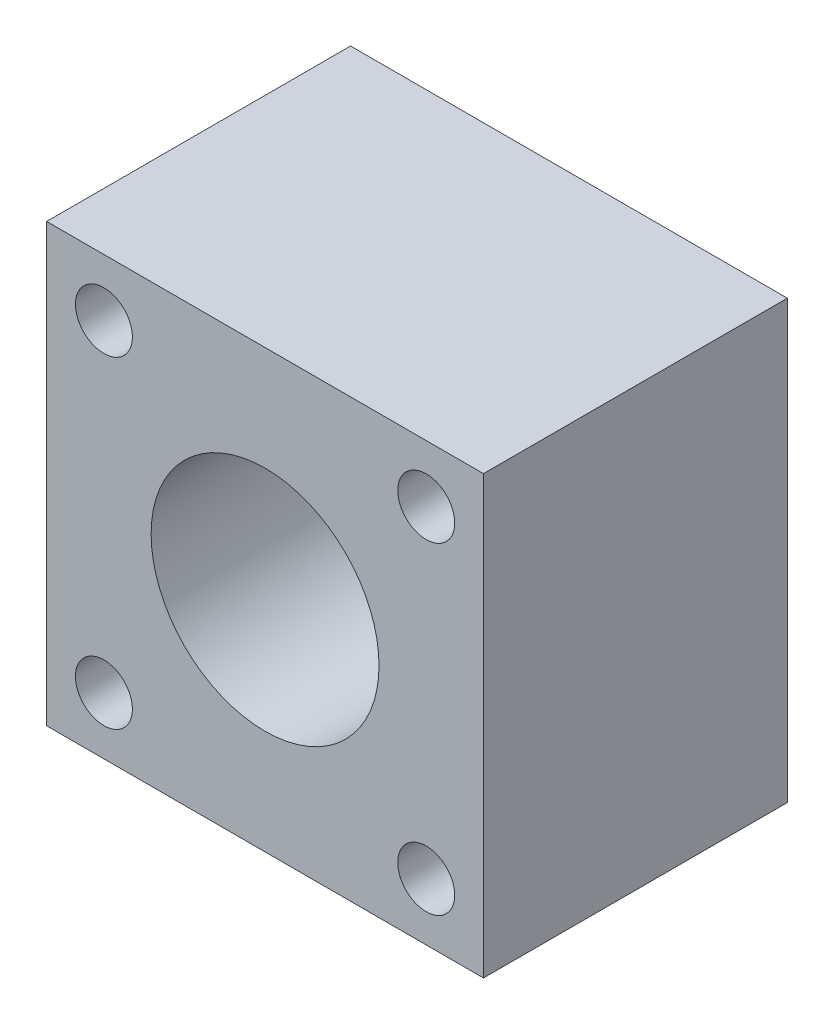
ISO-10303-21;
HEADER;
FILE_DESCRIPTION(('STEP AP214'),'2;1');
FILE_NAME('part.step','',(''),(''),'','','');
FILE_SCHEMA(('AUTOMOTIVE_DESIGN { 1 0 10303 214 1 1 1 1 }'));
ENDSEC;
DATA;
#1=APPLICATION_CONTEXT('core data for automotive mechanical design processes');
#2=APPLICATION_PROTOCOL_DEFINITION('international standard','automotive_design',2000,#1);
#3=PRODUCT_CONTEXT('',#1,'mechanical');
#4=PRODUCT('Part','Part','',(#3));
#5=PRODUCT_RELATED_PRODUCT_CATEGORY('part','',(#4));
#6=PRODUCT_DEFINITION_FORMATION('','',#4);
#7=PRODUCT_DEFINITION_CONTEXT('part definition',#1,'design');
#8=PRODUCT_DEFINITION('design','',#6,#7);
#9=PRODUCT_DEFINITION_SHAPE('','',#8);
#10=(LENGTH_UNIT() NAMED_UNIT(*) SI_UNIT(.MILLI.,.METRE.));
#11=(NAMED_UNIT(*) PLANE_ANGLE_UNIT() SI_UNIT($,.RADIAN.));
#12=(NAMED_UNIT(*) SI_UNIT($,.STERADIAN.) SOLID_ANGLE_UNIT());
#13=UNCERTAINTY_MEASURE_WITH_UNIT(LENGTH_MEASURE(1.E-05),#10,'distance_accuracy_value','');
#14=(GEOMETRIC_REPRESENTATION_CONTEXT(3) GLOBAL_UNCERTAINTY_ASSIGNED_CONTEXT((#13)) GLOBAL_UNIT_ASSIGNED_CONTEXT((#10,
#11,#12)) REPRESENTATION_CONTEXT('',''));
#15=CARTESIAN_POINT('',(0.,0.,0.));
#16=DIRECTION('',(0.,0.,1.));
#17=DIRECTION('',(1.,0.,0.));
#18=AXIS2_PLACEMENT_3D('',#15,#16,#17);
#19=CARTESIAN_POINT('',(0.,0.,11.));
#20=DIRECTION('',(0.,0.,-1.));
#21=DIRECTION('',(-1.,0.,0.));
#22=AXIS2_PLACEMENT_3D('',#19,#20,#21);
#23=CYLINDRICAL_SURFACE('',#22,6.);
#24=CARTESIAN_POINT('',(0.,0.,11.));
#25=DIRECTION('',(0.,0.,1.));
#26=DIRECTION('',(1.,0.,0.));
#27=AXIS2_PLACEMENT_3D('',#24,#25,#26);
#28=CIRCLE('',#27,6.);
#29=CARTESIAN_POINT('',(6.,0.,11.));
#30=VERTEX_POINT('',#29);
#31=EDGE_CURVE('E11',#30,#30,#28,.T.);
#32=ORIENTED_EDGE('',*,*,#31,.T.);
#33=EDGE_LOOP('',(#32));
#34=FACE_BOUND('',#33,.T.);
#35=CARTESIAN_POINT('',(0.,0.,0.));
#36=DIRECTION('',(0.,0.,1.));
#37=DIRECTION('',(1.,0.,0.));
#38=AXIS2_PLACEMENT_3D('',#35,#36,#37);
#39=CIRCLE('',#38,6.);
#40=CARTESIAN_POINT('',(6.,0.,0.));
#41=VERTEX_POINT('',#40);
#42=EDGE_CURVE('E124',#41,#41,#39,.T.);
#43=ORIENTED_EDGE('',*,*,#42,.F.);
#44=EDGE_LOOP('',(#43));
#45=FACE_BOUND('',#44,.T.);
#46=ADVANCED_FACE('F31',(#34,#45),#23,.F.);
#47=CARTESIAN_POINT('',(0.,-25.4414213562373,11.));
#48=DIRECTION('',(0.,0.,1.));
#49=DIRECTION('',(1.,0.,0.));
#50=AXIS2_PLACEMENT_3D('',#47,#48,#49);
#51=PLANE('',#50);
#52=ORIENTED_EDGE('',*,*,#31,.F.);
#53=EDGE_LOOP('',(#52));
#54=FACE_BOUND('',#53,.T.);
#55=CARTESIAN_POINT('',(-8.48528137423857,8.48528137423857,11.));
#56=DIRECTION('',(0.,0.,1.));
#57=DIRECTION('',(1.,0.,0.));
#58=AXIS2_PLACEMENT_3D('',#55,#56,#57);
#59=CIRCLE('',#58,1.5);
#60=CARTESIAN_POINT('',(-6.98528137423857,8.48528137423857,11.));
#61=VERTEX_POINT('',#60);
#62=EDGE_CURVE('E154',#61,#61,#59,.T.);
#63=ORIENTED_EDGE('',*,*,#62,.F.);
#64=EDGE_LOOP('',(#63));
#65=FACE_BOUND('',#64,.T.);
#66=CARTESIAN_POINT('',(-8.48528137423857,-8.48528137423857,11.));
#67=DIRECTION('',(0.,0.,1.));
#68=DIRECTION('',(1.,0.,0.));
#69=AXIS2_PLACEMENT_3D('',#66,#67,#68);
#70=CIRCLE('',#69,1.5);
#71=CARTESIAN_POINT('',(-6.98528137423857,-8.48528137423857,11.));
#72=VERTEX_POINT('',#71);
#73=EDGE_CURVE('E158',#72,#72,#70,.T.);
#74=ORIENTED_EDGE('',*,*,#73,.F.);
#75=EDGE_LOOP('',(#74));
#76=FACE_BOUND('',#75,.T.);
#77=CARTESIAN_POINT('',(8.48528137423857,-8.48528137423857,11.));
#78=DIRECTION('',(0.,0.,1.));
#79=DIRECTION('',(1.,0.,0.));
#80=AXIS2_PLACEMENT_3D('',#77,#78,#79);
#81=CIRCLE('',#80,1.5);
#82=CARTESIAN_POINT('',(9.98528137423857,-8.48528137423857,11.));
#83=VERTEX_POINT('',#82);
#84=EDGE_CURVE('E162',#83,#83,#81,.T.);
#85=ORIENTED_EDGE('',*,*,#84,.F.);
#86=EDGE_LOOP('',(#85));
#87=FACE_BOUND('',#86,.T.);
#88=CARTESIAN_POINT('',(8.48528137423857,8.48528137423857,11.));
#89=DIRECTION('',(0.,0.,1.));
#90=DIRECTION('',(1.,0.,0.));
#91=AXIS2_PLACEMENT_3D('',#88,#89,#90);
#92=CIRCLE('',#91,1.5);
#93=CARTESIAN_POINT('',(9.98528137423857,8.48528137423857,11.));
#94=VERTEX_POINT('',#93);
#95=EDGE_CURVE('E91',#94,#94,#92,.T.);
#96=ORIENTED_EDGE('',*,*,#95,.F.);
#97=EDGE_LOOP('',(#96));
#98=FACE_BOUND('',#97,.T.);
#99=DIRECTION('',(0.,-1.,0.));
#100=VECTOR('',#99,1.);
#101=CARTESIAN_POINT('',(11.5,-25.4414213562373,11.));
#102=LINE('',#101,#100);
#103=CARTESIAN_POINT('',(11.5,11.5,11.));
#104=VERTEX_POINT('',#103);
#105=CARTESIAN_POINT('',(11.5,-11.5,11.));
#106=VERTEX_POINT('',#105);
#107=EDGE_CURVE('E77',#104,#106,#102,.T.);
#108=ORIENTED_EDGE('',*,*,#107,.F.);
#109=DIRECTION('',(1.,0.,0.));
#110=VECTOR('',#109,1.);
#111=CARTESIAN_POINT('',(0.,11.5,11.));
#112=LINE('',#111,#110);
#113=CARTESIAN_POINT('',(-11.5,11.5,11.));
#114=VERTEX_POINT('',#113);
#115=EDGE_CURVE('E89',#114,#104,#112,.T.);
#116=ORIENTED_EDGE('',*,*,#115,.F.);
#117=DIRECTION('',(0.,-1.,0.));
#118=VECTOR('',#117,1.);
#119=CARTESIAN_POINT('',(-11.5,-25.4414213562373,11.));
#120=LINE('',#119,#118);
#121=CARTESIAN_POINT('',(-11.5,-11.5,11.));
#122=VERTEX_POINT('',#121);
#123=EDGE_CURVE('E95',#114,#122,#120,.T.);
#124=ORIENTED_EDGE('',*,*,#123,.T.);
#125=DIRECTION('',(1.,0.,0.));
#126=VECTOR('',#125,1.);
#127=CARTESIAN_POINT('',(0.,-11.5,11.));
#128=LINE('',#127,#126);
#129=EDGE_CURVE('E90',#122,#106,#128,.T.);
#130=ORIENTED_EDGE('',*,*,#129,.T.);
#131=EDGE_LOOP('',(#108,#116,#124,#130));
#132=FACE_BOUND('',#131,.T.);
#133=ADVANCED_FACE('F87',(#54,#65,#76,#87,#98,#132),#51,.T.);
#134=CARTESIAN_POINT('',(0.,-25.4414213562373,0.));
#135=DIRECTION('',(0.,0.,1.));
#136=DIRECTION('',(1.,0.,0.));
#137=AXIS2_PLACEMENT_3D('',#134,#135,#136);
#138=PLANE('',#137);
#139=ORIENTED_EDGE('',*,*,#42,.T.);
#140=EDGE_LOOP('',(#139));
#141=FACE_BOUND('',#140,.T.);
#142=CARTESIAN_POINT('',(0.,0.,0.));
#143=DIRECTION('',(0.,0.,1.));
#144=DIRECTION('',(1.,0.,0.));
#145=AXIS2_PLACEMENT_3D('',#142,#143,#144);
#146=CIRCLE('',#145,7.5);
#147=CARTESIAN_POINT('',(7.5,0.,0.));
#148=VERTEX_POINT('',#147);
#149=EDGE_CURVE('E34',#148,#148,#146,.T.);
#150=ORIENTED_EDGE('',*,*,#149,.F.);
#151=EDGE_LOOP('',(#150));
#152=FACE_BOUND('',#151,.T.);
#153=ADVANCED_FACE('F134',(#141,#152),#138,.F.);
#154=CARTESIAN_POINT('',(0.,0.,-5.));
#155=DIRECTION('',(0.,0.,1.));
#156=DIRECTION('',(1.,0.,0.));
#157=AXIS2_PLACEMENT_3D('',#154,#155,#156);
#158=CYLINDRICAL_SURFACE('',#157,7.5);
#159=CARTESIAN_POINT('',(0.,0.,-5.));
#160=DIRECTION('',(0.,0.,1.));
#161=DIRECTION('',(1.,0.,0.));
#162=AXIS2_PLACEMENT_3D('',#159,#160,#161);
#163=CIRCLE('',#162,7.5);
#164=CARTESIAN_POINT('',(7.5,0.,-5.));
#165=VERTEX_POINT('',#164);
#166=EDGE_CURVE('E113',#165,#165,#163,.T.);
#167=ORIENTED_EDGE('',*,*,#166,.F.);
#168=EDGE_LOOP('',(#167));
#169=FACE_BOUND('',#168,.T.);
#170=ORIENTED_EDGE('',*,*,#149,.T.);
#171=EDGE_LOOP('',(#170));
#172=FACE_BOUND('',#171,.T.);
#173=ADVANCED_FACE('F132',(#169,#172),#158,.F.);
#174=CARTESIAN_POINT('',(11.5,-25.4414213562373,-5.));
#175=DIRECTION('',(-1.,0.,0.));
#176=DIRECTION('',(0.,0.,1.));
#177=AXIS2_PLACEMENT_3D('',#174,#175,#176);
#178=PLANE('',#177);
#179=DIRECTION('',(0.,0.,1.));
#180=VECTOR('',#179,1.);
#181=CARTESIAN_POINT('',(11.5,11.5,-5.));
#182=LINE('',#181,#180);
#183=CARTESIAN_POINT('',(11.5,11.5,-5.));
#184=VERTEX_POINT('',#183);
#185=EDGE_CURVE('E74',#184,#104,#182,.T.);
#186=ORIENTED_EDGE('',*,*,#185,.T.);
#187=ORIENTED_EDGE('',*,*,#107,.T.);
#188=DIRECTION('',(0.,0.,1.));
#189=VECTOR('',#188,1.);
#190=CARTESIAN_POINT('',(11.5,-11.5,-5.));
#191=LINE('',#190,#189);
#192=CARTESIAN_POINT('',(11.5,-11.5,-5.));
#193=VERTEX_POINT('',#192);
#194=EDGE_CURVE('E122',#193,#106,#191,.T.);
#195=ORIENTED_EDGE('',*,*,#194,.F.);
#196=DIRECTION('',(0.,-1.,0.));
#197=VECTOR('',#196,1.);
#198=CARTESIAN_POINT('',(11.5,-25.4414213562373,-5.));
#199=LINE('',#198,#197);
#200=EDGE_CURVE('E46',#184,#193,#199,.T.);
#201=ORIENTED_EDGE('',*,*,#200,.F.);
#202=EDGE_LOOP('',(#186,#187,#195,#201));
#203=FACE_BOUND('',#202,.T.);
#204=ADVANCED_FACE('F76',(#203),#178,.F.);
#205=CARTESIAN_POINT('',(0.,-11.5,-5.));
#206=DIRECTION('',(0.,-1.,0.));
#207=DIRECTION('',(0.,0.,-1.));
#208=AXIS2_PLACEMENT_3D('',#205,#206,#207);
#209=PLANE('',#208);
#210=ORIENTED_EDGE('',*,*,#194,.T.);
#211=ORIENTED_EDGE('',*,*,#129,.F.);
#212=DIRECTION('',(0.,0.,1.));
#213=VECTOR('',#212,1.);
#214=CARTESIAN_POINT('',(-11.5,-11.5,-5.));
#215=LINE('',#214,#213);
#216=CARTESIAN_POINT('',(-11.5,-11.5,-5.));
#217=VERTEX_POINT('',#216);
#218=EDGE_CURVE('E54',#217,#122,#215,.T.);
#219=ORIENTED_EDGE('',*,*,#218,.F.);
#220=DIRECTION('',(1.,0.,0.));
#221=VECTOR('',#220,1.);
#222=CARTESIAN_POINT('',(0.,-11.5,-5.));
#223=LINE('',#222,#221);
#224=EDGE_CURVE('E82',#217,#193,#223,.T.);
#225=ORIENTED_EDGE('',*,*,#224,.T.);
#226=EDGE_LOOP('',(#210,#211,#219,#225));
#227=FACE_BOUND('',#226,.T.);
#228=ADVANCED_FACE('F195',(#227),#209,.T.);
#229=CARTESIAN_POINT('',(-11.5,-25.4414213562373,-5.));
#230=DIRECTION('',(-1.,0.,0.));
#231=DIRECTION('',(0.,0.,1.));
#232=AXIS2_PLACEMENT_3D('',#229,#230,#231);
#233=PLANE('',#232);
#234=ORIENTED_EDGE('',*,*,#218,.T.);
#235=ORIENTED_EDGE('',*,*,#123,.F.);
#236=DIRECTION('',(0.,0.,1.));
#237=VECTOR('',#236,1.);
#238=CARTESIAN_POINT('',(-11.5,11.5,-5.));
#239=LINE('',#238,#237);
#240=CARTESIAN_POINT('',(-11.5,11.5,-5.));
#241=VERTEX_POINT('',#240);
#242=EDGE_CURVE('E81',#241,#114,#239,.T.);
#243=ORIENTED_EDGE('',*,*,#242,.F.);
#244=DIRECTION('',(0.,-1.,0.));
#245=VECTOR('',#244,1.);
#246=CARTESIAN_POINT('',(-11.5,-25.4414213562373,-5.));
#247=LINE('',#246,#245);
#248=EDGE_CURVE('E119',#241,#217,#247,.T.);
#249=ORIENTED_EDGE('',*,*,#248,.T.);
#250=EDGE_LOOP('',(#234,#235,#243,#249));
#251=FACE_BOUND('',#250,.T.);
#252=ADVANCED_FACE('F191',(#251),#233,.T.);
#253=CARTESIAN_POINT('',(8.48528137423857,8.48528137423857,-5.));
#254=DIRECTION('',(0.,0.,1.));
#255=DIRECTION('',(1.,0.,0.));
#256=AXIS2_PLACEMENT_3D('',#253,#254,#255);
#257=CYLINDRICAL_SURFACE('',#256,1.5);
#258=CARTESIAN_POINT('',(8.48528137423857,8.48528137423857,-5.));
#259=DIRECTION('',(0.,0.,1.));
#260=DIRECTION('',(1.,0.,0.));
#261=AXIS2_PLACEMENT_3D('',#258,#259,#260);
#262=CIRCLE('',#261,1.5);
#263=CARTESIAN_POINT('',(9.98528137423857,8.48528137423857,-5.));
#264=VERTEX_POINT('',#263);
#265=EDGE_CURVE('E110',#264,#264,#262,.T.);
#266=ORIENTED_EDGE('',*,*,#265,.F.);
#267=EDGE_LOOP('',(#266));
#268=FACE_BOUND('',#267,.T.);
#269=ORIENTED_EDGE('',*,*,#95,.T.);
#270=EDGE_LOOP('',(#269));
#271=FACE_BOUND('',#270,.T.);
#272=ADVANCED_FACE('F188',(#268,#271),#257,.F.);
#273=CARTESIAN_POINT('',(8.48528137423857,-8.48528137423857,-5.));
#274=DIRECTION('',(0.,0.,1.));
#275=DIRECTION('',(1.,0.,0.));
#276=AXIS2_PLACEMENT_3D('',#273,#274,#275);
#277=CYLINDRICAL_SURFACE('',#276,1.5);
#278=CARTESIAN_POINT('',(8.48528137423857,-8.48528137423857,-5.));
#279=DIRECTION('',(0.,0.,1.));
#280=DIRECTION('',(1.,0.,0.));
#281=AXIS2_PLACEMENT_3D('',#278,#279,#280);
#282=CIRCLE('',#281,1.5);
#283=CARTESIAN_POINT('',(9.98528137423857,-8.48528137423857,-5.));
#284=VERTEX_POINT('',#283);
#285=EDGE_CURVE('E107',#284,#284,#282,.T.);
#286=ORIENTED_EDGE('',*,*,#285,.F.);
#287=EDGE_LOOP('',(#286));
#288=FACE_BOUND('',#287,.T.);
#289=ORIENTED_EDGE('',*,*,#84,.T.);
#290=EDGE_LOOP('',(#289));
#291=FACE_BOUND('',#290,.T.);
#292=ADVANCED_FACE('F181',(#288,#291),#277,.F.);
#293=CARTESIAN_POINT('',(-8.48528137423857,-8.48528137423857,-5.));
#294=DIRECTION('',(0.,0.,1.));
#295=DIRECTION('',(1.,0.,0.));
#296=AXIS2_PLACEMENT_3D('',#293,#294,#295);
#297=CYLINDRICAL_SURFACE('',#296,1.5);
#298=CARTESIAN_POINT('',(-8.48528137423857,-8.48528137423857,-5.));
#299=DIRECTION('',(0.,0.,1.));
#300=DIRECTION('',(1.,0.,0.));
#301=AXIS2_PLACEMENT_3D('',#298,#299,#300);
#302=CIRCLE('',#301,1.5);
#303=CARTESIAN_POINT('',(-6.98528137423857,-8.48528137423857,-5.));
#304=VERTEX_POINT('',#303);
#305=EDGE_CURVE('E104',#304,#304,#302,.T.);
#306=ORIENTED_EDGE('',*,*,#305,.F.);
#307=EDGE_LOOP('',(#306));
#308=FACE_BOUND('',#307,.T.);
#309=ORIENTED_EDGE('',*,*,#73,.T.);
#310=EDGE_LOOP('',(#309));
#311=FACE_BOUND('',#310,.T.);
#312=ADVANCED_FACE('F172',(#308,#311),#297,.F.);
#313=CARTESIAN_POINT('',(-8.48528137423857,8.48528137423857,-5.));
#314=DIRECTION('',(0.,0.,1.));
#315=DIRECTION('',(1.,0.,0.));
#316=AXIS2_PLACEMENT_3D('',#313,#314,#315);
#317=CYLINDRICAL_SURFACE('',#316,1.5);
#318=CARTESIAN_POINT('',(-8.48528137423857,8.48528137423857,-5.));
#319=DIRECTION('',(0.,0.,1.));
#320=DIRECTION('',(1.,0.,0.));
#321=AXIS2_PLACEMENT_3D('',#318,#319,#320);
#322=CIRCLE('',#321,1.5);
#323=CARTESIAN_POINT('',(-6.98528137423857,8.48528137423857,-5.));
#324=VERTEX_POINT('',#323);
#325=EDGE_CURVE('E101',#324,#324,#322,.T.);
#326=ORIENTED_EDGE('',*,*,#325,.F.);
#327=EDGE_LOOP('',(#326));
#328=FACE_BOUND('',#327,.T.);
#329=ORIENTED_EDGE('',*,*,#62,.T.);
#330=EDGE_LOOP('',(#329));
#331=FACE_BOUND('',#330,.T.);
#332=ADVANCED_FACE('F170',(#328,#331),#317,.F.);
#333=CARTESIAN_POINT('',(0.,11.5,-5.));
#334=DIRECTION('',(0.,-1.,0.));
#335=DIRECTION('',(0.,0.,-1.));
#336=AXIS2_PLACEMENT_3D('',#333,#334,#335);
#337=PLANE('',#336);
#338=ORIENTED_EDGE('',*,*,#242,.T.);
#339=ORIENTED_EDGE('',*,*,#115,.T.);
#340=ORIENTED_EDGE('',*,*,#185,.F.);
#341=DIRECTION('',(1.,0.,0.));
#342=VECTOR('',#341,1.);
#343=CARTESIAN_POINT('',(0.,11.5,-5.));
#344=LINE('',#343,#342);
#345=EDGE_CURVE('E117',#241,#184,#344,.T.);
#346=ORIENTED_EDGE('',*,*,#345,.F.);
#347=EDGE_LOOP('',(#338,#339,#340,#346));
#348=FACE_BOUND('',#347,.T.);
#349=ADVANCED_FACE('F93',(#348),#337,.F.);
#350=CARTESIAN_POINT('',(0.,-25.4414213562373,-5.));
#351=DIRECTION('',(0.,0.,1.));
#352=DIRECTION('',(1.,0.,0.));
#353=AXIS2_PLACEMENT_3D('',#350,#351,#352);
#354=PLANE('',#353);
#355=ORIENTED_EDGE('',*,*,#325,.T.);
#356=EDGE_LOOP('',(#355));
#357=FACE_BOUND('',#356,.T.);
#358=ORIENTED_EDGE('',*,*,#305,.T.);
#359=EDGE_LOOP('',(#358));
#360=FACE_BOUND('',#359,.T.);
#361=ORIENTED_EDGE('',*,*,#285,.T.);
#362=EDGE_LOOP('',(#361));
#363=FACE_BOUND('',#362,.T.);
#364=ORIENTED_EDGE('',*,*,#265,.T.);
#365=EDGE_LOOP('',(#364));
#366=FACE_BOUND('',#365,.T.);
#367=ORIENTED_EDGE('',*,*,#166,.T.);
#368=EDGE_LOOP('',(#367));
#369=FACE_BOUND('',#368,.T.);
#370=ORIENTED_EDGE('',*,*,#200,.T.);
#371=ORIENTED_EDGE('',*,*,#224,.F.);
#372=ORIENTED_EDGE('',*,*,#248,.F.);
#373=ORIENTED_EDGE('',*,*,#345,.T.);
#374=EDGE_LOOP('',(#370,#371,#372,#373));
#375=FACE_BOUND('',#374,.T.);
#376=ADVANCED_FACE('F179',(#357,#360,#363,#366,#369,#375),#354,.F.);
#377=CLOSED_SHELL('',(#46,#133,#153,#173,#204,#228,#252,#272,#292,#312,#332,#349,#376));
#378=MANIFOLD_SOLID_BREP('B2',#377);
#379=ADVANCED_BREP_SHAPE_REPRESENTATION('',(#18,#378),#14);
#380=SHAPE_DEFINITION_REPRESENTATION(#9,#379);
ENDSEC;
END-ISO-10303-21;
